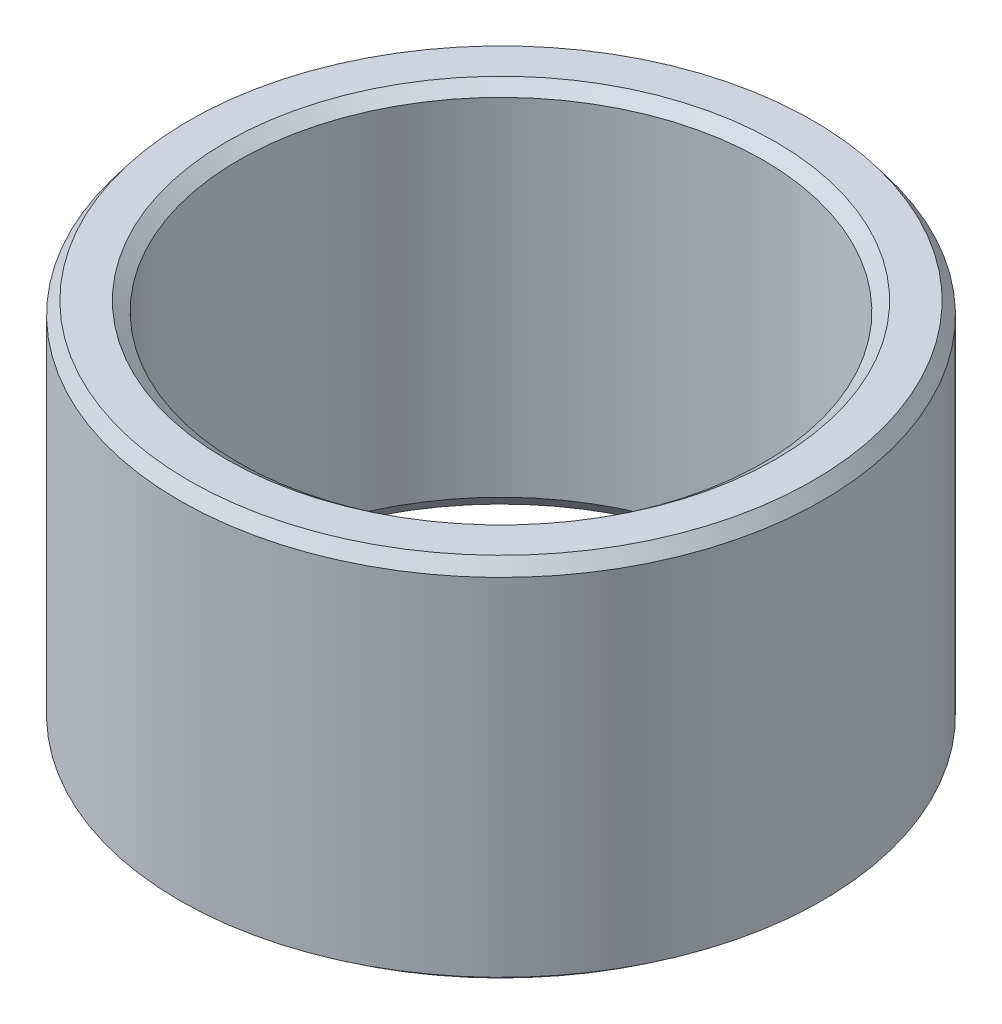
ISO-10303-21;
HEADER;
FILE_DESCRIPTION(('STEP AP214'),'2;1');
FILE_NAME('part.step','',(''),(''),'','','');
FILE_SCHEMA(('AUTOMOTIVE_DESIGN { 1 0 10303 214 1 1 1 1 }'));
ENDSEC;
DATA;
#1=APPLICATION_CONTEXT('core data for automotive mechanical design processes');
#2=APPLICATION_PROTOCOL_DEFINITION('international standard','automotive_design',2000,#1);
#3=PRODUCT_CONTEXT('',#1,'mechanical');
#4=PRODUCT('Part','Part','',(#3));
#5=PRODUCT_RELATED_PRODUCT_CATEGORY('part','',(#4));
#6=PRODUCT_DEFINITION_FORMATION('','',#4);
#7=PRODUCT_DEFINITION_CONTEXT('part definition',#1,'design');
#8=PRODUCT_DEFINITION('design','',#6,#7);
#9=PRODUCT_DEFINITION_SHAPE('','',#8);
#10=(LENGTH_UNIT() NAMED_UNIT(*) SI_UNIT(.MILLI.,.METRE.));
#11=(NAMED_UNIT(*) PLANE_ANGLE_UNIT() SI_UNIT($,.RADIAN.));
#12=(NAMED_UNIT(*) SI_UNIT($,.STERADIAN.) SOLID_ANGLE_UNIT());
#13=UNCERTAINTY_MEASURE_WITH_UNIT(LENGTH_MEASURE(1.E-05),#10,'distance_accuracy_value','');
#14=(GEOMETRIC_REPRESENTATION_CONTEXT(3) GLOBAL_UNCERTAINTY_ASSIGNED_CONTEXT((#13)) GLOBAL_UNIT_ASSIGNED_CONTEXT((#10,
#11,#12)) REPRESENTATION_CONTEXT('',''));
#15=CARTESIAN_POINT('',(0.,0.,0.));
#16=DIRECTION('',(0.,0.,1.));
#17=DIRECTION('',(1.,0.,0.));
#18=AXIS2_PLACEMENT_3D('',#15,#16,#17);
#19=CARTESIAN_POINT('',(0.,63.0334470750999,0.));
#20=DIRECTION('',(0.,-1.,0.));
#21=DIRECTION('',(0.,0.,-1.));
#22=AXIS2_PLACEMENT_3D('',#19,#20,#21);
#23=CYLINDRICAL_SURFACE('',#22,55.);
#24=CARTESIAN_POINT('',(0.,1.61209998064965,0.));
#25=DIRECTION('',(0.,1.,0.));
#26=DIRECTION('',(0.,0.,1.));
#27=AXIS2_PLACEMENT_3D('',#24,#25,#26);
#28=CIRCLE('',#27,55.);
#29=CARTESIAN_POINT('',(0.,1.61209998064965,55.));
#30=VERTEX_POINT('',#29);
#31=EDGE_CURVE('E10',#30,#30,#28,.T.);
#32=ORIENTED_EDGE('',*,*,#31,.T.);
#33=EDGE_LOOP('',(#32));
#34=FACE_BOUND('',#33,.T.);
#35=CARTESIAN_POINT('',(0.,60.8854444094237,0.));
#36=DIRECTION('',(0.,1.,0.));
#37=DIRECTION('',(0.,0.,1.));
#38=AXIS2_PLACEMENT_3D('',#35,#36,#37);
#39=CIRCLE('',#38,55.);
#40=CARTESIAN_POINT('',(0.,60.8854444094237,55.));
#41=VERTEX_POINT('',#40);
#42=EDGE_CURVE('E50',#41,#41,#39,.F.);
#43=ORIENTED_EDGE('',*,*,#42,.T.);
#44=EDGE_LOOP('',(#43));
#45=FACE_BOUND('',#44,.T.);
#46=ADVANCED_FACE('F39',(#34,#45),#23,.T.);
#47=CARTESIAN_POINT('',(0.,63.0334470750999,0.));
#48=DIRECTION('',(0.,1.,0.));
#49=DIRECTION('',(0.,0.,1.));
#50=AXIS2_PLACEMENT_3D('',#47,#48,#49);
#51=PLANE('',#50);
#52=CARTESIAN_POINT('',(0.,63.0334470750999,0.));
#53=DIRECTION('',(0.,1.,0.));
#54=DIRECTION('',(0.,0.,1.));
#55=AXIS2_PLACEMENT_3D('',#52,#53,#54);
#56=CIRCLE('',#55,47.0316919888287);
#57=CARTESIAN_POINT('',(0.,63.0334470750999,47.0316919888287));
#58=VERTEX_POINT('',#57);
#59=EDGE_CURVE('E58',#58,#58,#56,.F.);
#60=ORIENTED_EDGE('',*,*,#59,.T.);
#61=EDGE_LOOP('',(#60));
#62=FACE_BOUND('',#61,.T.);
#63=CARTESIAN_POINT('',(0.,63.0334470750999,0.));
#64=DIRECTION('',(0.,1.,0.));
#65=DIRECTION('',(0.,0.,1.));
#66=AXIS2_PLACEMENT_3D('',#63,#64,#65);
#67=CIRCLE('',#66,53.3879000193503);
#68=CARTESIAN_POINT('',(0.,63.0334470750999,53.3879000193503));
#69=VERTEX_POINT('',#68);
#70=EDGE_CURVE('E61',#69,#69,#67,.T.);
#71=ORIENTED_EDGE('',*,*,#70,.T.);
#72=EDGE_LOOP('',(#71));
#73=FACE_BOUND('',#72,.T.);
#74=ADVANCED_FACE('F88',(#62,#73),#51,.T.);
#75=CARTESIAN_POINT('',(0.,0.,0.));
#76=DIRECTION('',(0.,1.,0.));
#77=DIRECTION('',(0.,0.,1.));
#78=AXIS2_PLACEMENT_3D('',#75,#76,#77);
#79=PLANE('',#78);
#80=CARTESIAN_POINT('',(0.,0.,0.));
#81=DIRECTION('',(0.,1.,0.));
#82=DIRECTION('',(0.,0.,1.));
#83=AXIS2_PLACEMENT_3D('',#80,#81,#82);
#84=CIRCLE('',#83,46.4957893038021);
#85=CARTESIAN_POINT('',(0.,0.,46.4957893038021));
#86=VERTEX_POINT('',#85);
#87=EDGE_CURVE('E51',#86,#86,#84,.T.);
#88=ORIENTED_EDGE('',*,*,#87,.T.);
#89=EDGE_LOOP('',(#88));
#90=FACE_BOUND('',#89,.T.);
#91=CARTESIAN_POINT('',(0.,0.,0.));
#92=DIRECTION('',(0.,1.,0.));
#93=DIRECTION('',(0.,0.,1.));
#94=AXIS2_PLACEMENT_3D('',#91,#92,#93);
#95=CIRCLE('',#94,52.8519973343237);
#96=CARTESIAN_POINT('',(0.,0.,52.8519973343237));
#97=VERTEX_POINT('',#96);
#98=EDGE_CURVE('E54',#97,#97,#95,.F.);
#99=ORIENTED_EDGE('',*,*,#98,.T.);
#100=EDGE_LOOP('',(#99));
#101=FACE_BOUND('',#100,.T.);
#102=ADVANCED_FACE('F83',(#90,#101),#79,.F.);
#103=CARTESIAN_POINT('',(0.,63.0334470750999,0.));
#104=DIRECTION('',(0.,-1.,0.));
#105=DIRECTION('',(0.,0.,-1.));
#106=AXIS2_PLACEMENT_3D('',#103,#104,#105);
#107=CYLINDRICAL_SURFACE('',#106,44.8836893231524);
#108=CARTESIAN_POINT('',(0.,61.4213470944503,0.));
#109=DIRECTION('',(0.,1.,0.));
#110=DIRECTION('',(0.,0.,1.));
#111=AXIS2_PLACEMENT_3D('',#108,#109,#110);
#112=CIRCLE('',#111,44.8836893231524);
#113=CARTESIAN_POINT('',(0.,61.4213470944503,44.8836893231524));
#114=VERTEX_POINT('',#113);
#115=EDGE_CURVE('E67',#114,#114,#112,.T.);
#116=ORIENTED_EDGE('',*,*,#115,.T.);
#117=EDGE_LOOP('',(#116));
#118=FACE_BOUND('',#117,.T.);
#119=CARTESIAN_POINT('',(0.,2.14800266567629,0.));
#120=DIRECTION('',(0.,1.,0.));
#121=DIRECTION('',(0.,0.,1.));
#122=AXIS2_PLACEMENT_3D('',#119,#120,#121);
#123=CIRCLE('',#122,44.8836893231524);
#124=CARTESIAN_POINT('',(0.,2.14800266567629,44.8836893231524));
#125=VERTEX_POINT('',#124);
#126=EDGE_CURVE('E69',#125,#125,#123,.F.);
#127=ORIENTED_EDGE('',*,*,#126,.T.);
#128=EDGE_LOOP('',(#127));
#129=FACE_BOUND('',#128,.T.);
#130=ADVANCED_FACE('F71',(#118,#129),#107,.F.);
#131=CARTESIAN_POINT('',(0.,61.4213470944503,0.));
#132=DIRECTION('',(0.,1.,0.));
#133=DIRECTION('',(0.,0.,1.));
#134=AXIS2_PLACEMENT_3D('',#131,#132,#133);
#135=CONICAL_SURFACE('',#134,44.8836893231524,0.926968153373567);
#136=CARTESIAN_POINT('',(0.,63.0334470750999,47.0316919888287));
#137=CARTESIAN_POINT('',(0.,63.0166543669682,47.0093169610612));
#138=CARTESIAN_POINT('',(0.,62.9998616588364,46.9869419332937));
#139=CARTESIAN_POINT('',(0.,62.9662762425729,46.9421918777588));
#140=CARTESIAN_POINT('',(0.,62.9494835344411,46.9198168499914));
#141=CARTESIAN_POINT('',(0.,62.9158981181776,46.8750667944564));
#142=CARTESIAN_POINT('',(0.,62.8991054100458,46.852691766689));
#143=CARTESIAN_POINT('',(0.,62.8655199937823,46.8079417111541));
#144=CARTESIAN_POINT('',(0.,62.8487272856505,46.7855666833866));
#145=CARTESIAN_POINT('',(0.,62.815141869387,46.7408166278517));
#146=CARTESIAN_POINT('',(0.,62.7983491612552,46.7184416000842));
#147=CARTESIAN_POINT('',(0.,62.7647637449917,46.6736915445493));
#148=CARTESIAN_POINT('',(0.,62.7479710368599,46.6513165167818));
#149=CARTESIAN_POINT('',(0.,62.7143856205964,46.6065664612469));
#150=CARTESIAN_POINT('',(0.,62.6975929124646,46.5841914334794));
#151=CARTESIAN_POINT('',(0.,62.6640074962011,46.5394413779445));
#152=CARTESIAN_POINT('',(0.,62.6472147880693,46.5170663501771));
#153=CARTESIAN_POINT('',(0.,62.6136293718058,46.4723162946421));
#154=CARTESIAN_POINT('',(0.,62.596836663674,46.4499412668747));
#155=CARTESIAN_POINT('',(0.,62.5632512474105,46.4051912113398));
#156=CARTESIAN_POINT('',(0.,62.5464585392787,46.3828161835723));
#157=CARTESIAN_POINT('',(0.,62.5128731230151,46.3380661280374));
#158=CARTESIAN_POINT('',(0.,62.4960804148834,46.3156911002699));
#159=CARTESIAN_POINT('',(0.,62.4624949986198,46.270941044735));
#160=CARTESIAN_POINT('',(0.,62.4457022904881,46.2485660169675));
#161=CARTESIAN_POINT('',(0.,62.4121168742245,46.2038159614326));
#162=CARTESIAN_POINT('',(0.,62.3953241660928,46.1814409336651));
#163=CARTESIAN_POINT('',(0.,62.3617387498292,46.1366908781302));
#164=CARTESIAN_POINT('',(0.,62.3449460416975,46.1143158503628));
#165=CARTESIAN_POINT('',(0.,62.3113606254339,46.0695657948278));
#166=CARTESIAN_POINT('',(0.,62.2945679173022,46.0471907670604));
#167=CARTESIAN_POINT('',(0.,62.2609825010386,46.0024407115255));
#168=CARTESIAN_POINT('',(0.,62.2441897929069,45.980065683758));
#169=CARTESIAN_POINT('',(0.,62.2106043766433,45.9353156282231));
#170=CARTESIAN_POINT('',(0.,62.1938116685116,45.9129406004556));
#171=CARTESIAN_POINT('',(0.,62.160226252248,45.8681905449207));
#172=CARTESIAN_POINT('',(0.,62.1434335441163,45.8458155171532));
#173=CARTESIAN_POINT('',(0.,62.1098481278527,45.8010654616183));
#174=CARTESIAN_POINT('',(0.,62.093055419721,45.7786904338508));
#175=CARTESIAN_POINT('',(0.,62.0594700034574,45.7339403783159));
#176=CARTESIAN_POINT('',(0.,62.0426772953257,45.7115653505485));
#177=CARTESIAN_POINT('',(0.,62.0090918790621,45.6668152950135));
#178=CARTESIAN_POINT('',(0.,61.9922991709304,45.6444402672461));
#179=CARTESIAN_POINT('',(0.,61.9587137546668,45.5996902117112));
#180=CARTESIAN_POINT('',(0.,61.9419210465351,45.5773151839437));
#181=CARTESIAN_POINT('',(0.,61.9083356302715,45.5325651284088));
#182=CARTESIAN_POINT('',(0.,61.8915429221398,45.5101901006413));
#183=CARTESIAN_POINT('',(0.,61.8579575058762,45.4654400451064));
#184=CARTESIAN_POINT('',(0.,61.8411647977445,45.4430650173389));
#185=CARTESIAN_POINT('',(0.,61.8075793814809,45.398314961804));
#186=CARTESIAN_POINT('',(0.,61.7907866733492,45.3759399340365));
#187=CARTESIAN_POINT('',(0.,61.7572012570856,45.3311898785016));
#188=CARTESIAN_POINT('',(0.,61.7404085489539,45.3088148507342));
#189=CARTESIAN_POINT('',(0.,61.7068231326903,45.2640647951992));
#190=CARTESIAN_POINT('',(0.,61.6900304245586,45.2416897674318));
#191=CARTESIAN_POINT('',(0.,61.656445008295,45.1969397118969));
#192=CARTESIAN_POINT('',(0.,61.6396523001633,45.1745646841294));
#193=CARTESIAN_POINT('',(0.,61.6060668838997,45.1298146285945));
#194=CARTESIAN_POINT('',(0.,61.589274175768,45.107439600827));
#195=CARTESIAN_POINT('',(0.,61.5556887595044,45.0626895452921));
#196=CARTESIAN_POINT('',(0.,61.5388960513727,45.0403145175246));
#197=CARTESIAN_POINT('',(0.,61.5053106351091,44.9955644619897));
#198=CARTESIAN_POINT('',(0.,61.4885179269774,44.9731894342222));
#199=CARTESIAN_POINT('',(0.,61.4549325107138,44.9284393786873));
#200=CARTESIAN_POINT('',(0.,61.4381398025821,44.9060643509199));
#201=CARTESIAN_POINT('',(0.,61.4213470944503,44.8836893231524));
#202=B_SPLINE_CURVE_WITH_KNOTS('',3,(#136,#137,#138,#139,#140,#141,#142,#143,#144,#145,#146,
#147,#148,#149,#150,#151,#152,#153,#154,#155,#156,#157,#158,#159,#160,#161,#162,#163,#164,#165,
#166,#167,#168,#169,#170,#171,#172,#173,#174,#175,#176,#177,#178,#179,#180,#181,#182,#183,#184,
#185,#186,#187,#188,#189,#190,#191,#192,#193,#194,#195,#196,#197,#198,#199,#200,#201),
.UNSPECIFIED.,.F.,.F.,(4,2,2,2,2,2,2,2,2,2,2,2,2,2,2,2,2,2,2,2,2,2,2,2,2,2,2,2,2,2,2,2,4),(0.,
0.0839269457679776,0.16785389153595,0.251780837303927,0.335707783071899,0.419634728839871,
0.503561674607849,0.587488620375813,0.67141556614379,0.755342511911762,0.839269457679734,
0.923196403447712,1.00712334921568,1.09105029498366,1.17497724075163,1.25890418651961,
1.34283113228758,1.42675807805555,1.51068502382352,1.59461196959149,1.67853891535947,
1.76246586112744,1.84639280689541,1.93031975266339,2.01424669843136,2.09817364419934,
2.18210058996731,2.26602753573528,2.34995448150325,2.43388142727122,2.5178083730392,
2.60173531880717,2.68566226457515),.UNSPECIFIED.);
#203=EDGE_CURVE('BSEAM77',#58,#114,#202,.T.);
#204=ORIENTED_EDGE('',*,*,#59,.F.);
#205=ORIENTED_EDGE('',*,*,#115,.F.);
#206=ORIENTED_EDGE('',*,*,#203,.T.);
#207=ORIENTED_EDGE('',*,*,#203,.F.);
#208=EDGE_LOOP('',(#204,#206,#205,#207));
#209=FACE_BOUND('',#208,.T.);
#210=ADVANCED_FACE('F77',(#209),#135,.F.);
#211=CARTESIAN_POINT('',(0.,0.,0.));
#212=DIRECTION('',(0.,-1.,0.));
#213=DIRECTION('',(0.,0.,-1.));
#214=AXIS2_PLACEMENT_3D('',#211,#212,#213);
#215=CONICAL_SURFACE('',#214,46.4957893038021,0.643828173421334);
#216=ORIENTED_EDGE('',*,*,#126,.F.);
#217=EDGE_LOOP('',(#216));
#218=FACE_BOUND('',#217,.T.);
#219=ORIENTED_EDGE('',*,*,#87,.F.);
#220=EDGE_LOOP('',(#219));
#221=FACE_BOUND('',#220,.T.);
#222=ADVANCED_FACE('F73',(#218,#221),#215,.F.);
#223=CARTESIAN_POINT('',(0.,1.61209998064965,0.));
#224=DIRECTION('',(0.,1.,0.));
#225=DIRECTION('',(0.,0.,1.));
#226=AXIS2_PLACEMENT_3D('',#223,#224,#225);
#227=CONICAL_SURFACE('',#226,55.,0.926968153373569);
#228=ORIENTED_EDGE('',*,*,#98,.F.);
#229=EDGE_LOOP('',(#228));
#230=FACE_BOUND('',#229,.T.);
#231=ORIENTED_EDGE('',*,*,#31,.F.);
#232=EDGE_LOOP('',(#231));
#233=FACE_BOUND('',#232,.T.);
#234=ADVANCED_FACE('F76',(#230,#233),#227,.T.);
#235=CARTESIAN_POINT('',(0.,63.0334470750999,0.));
#236=DIRECTION('',(0.,-1.,0.));
#237=DIRECTION('',(0.,0.,-1.));
#238=AXIS2_PLACEMENT_3D('',#235,#236,#237);
#239=CONICAL_SURFACE('',#238,53.3879000193503,0.643828173421337);
#240=ORIENTED_EDGE('',*,*,#42,.F.);
#241=EDGE_LOOP('',(#240));
#242=FACE_BOUND('',#241,.T.);
#243=ORIENTED_EDGE('',*,*,#70,.F.);
#244=EDGE_LOOP('',(#243));
#245=FACE_BOUND('',#244,.T.);
#246=ADVANCED_FACE('F45',(#242,#245),#239,.T.);
#247=CLOSED_SHELL('',(#46,#74,#102,#130,#210,#222,#234,#246));
#248=MANIFOLD_SOLID_BREP('B2',#247);
#249=ADVANCED_BREP_SHAPE_REPRESENTATION('',(#18,#248),#14);
#250=SHAPE_DEFINITION_REPRESENTATION(#9,#249);
ENDSEC;
END-ISO-10303-21;
